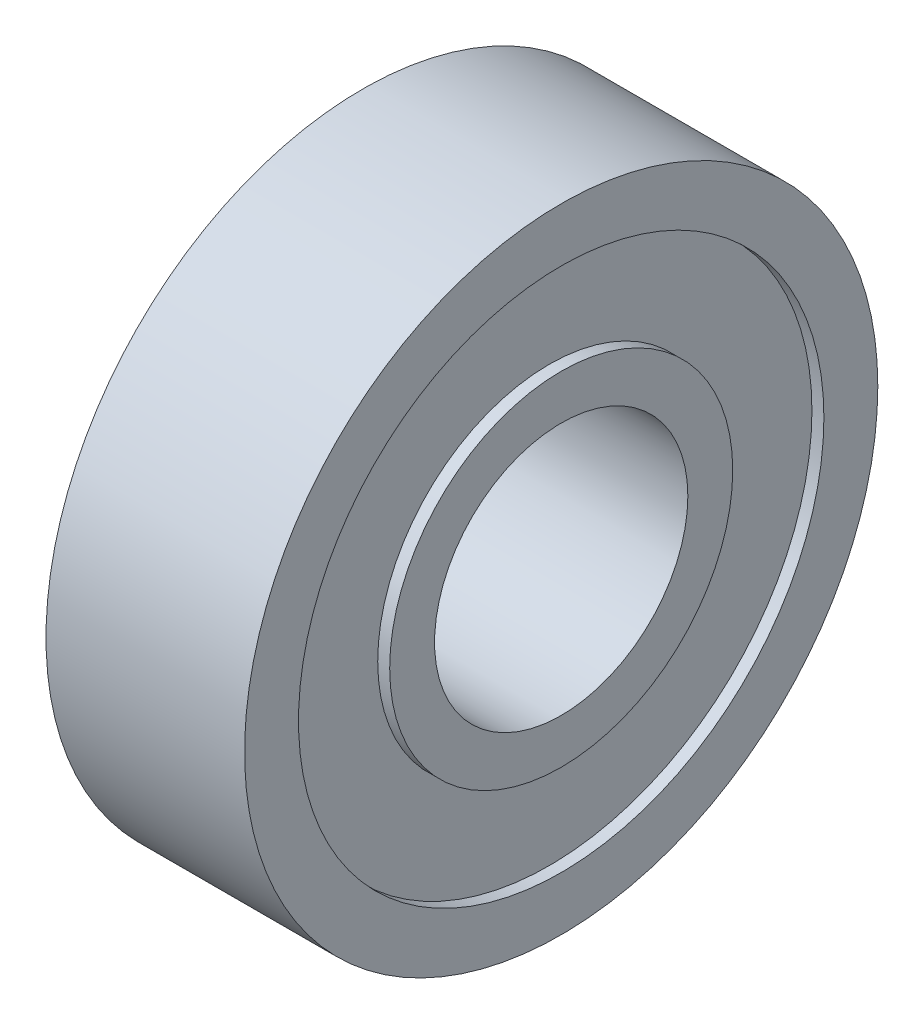
ISO-10303-21;
HEADER;
FILE_DESCRIPTION(('STEP AP214'),'2;1');
FILE_NAME('part.step','',(''),(''),'','','');
FILE_SCHEMA(('AUTOMOTIVE_DESIGN { 1 0 10303 214 1 1 1 1 }'));
ENDSEC;
DATA;
#1=APPLICATION_CONTEXT('core data for automotive mechanical design processes');
#2=APPLICATION_PROTOCOL_DEFINITION('international standard','automotive_design',2000,#1);
#3=PRODUCT_CONTEXT('',#1,'mechanical');
#4=PRODUCT('Part','Part','',(#3));
#5=PRODUCT_RELATED_PRODUCT_CATEGORY('part','',(#4));
#6=PRODUCT_DEFINITION_FORMATION('','',#4);
#7=PRODUCT_DEFINITION_CONTEXT('part definition',#1,'design');
#8=PRODUCT_DEFINITION('design','',#6,#7);
#9=PRODUCT_DEFINITION_SHAPE('','',#8);
#10=(LENGTH_UNIT() NAMED_UNIT(*) SI_UNIT(.MILLI.,.METRE.));
#11=(NAMED_UNIT(*) PLANE_ANGLE_UNIT() SI_UNIT($,.RADIAN.));
#12=(NAMED_UNIT(*) SI_UNIT($,.STERADIAN.) SOLID_ANGLE_UNIT());
#13=UNCERTAINTY_MEASURE_WITH_UNIT(LENGTH_MEASURE(1.E-05),#10,'distance_accuracy_value','');
#14=(GEOMETRIC_REPRESENTATION_CONTEXT(3) GLOBAL_UNCERTAINTY_ASSIGNED_CONTEXT((#13)) GLOBAL_UNIT_ASSIGNED_CONTEXT((#10,
#11,#12)) REPRESENTATION_CONTEXT('',''));
#15=CARTESIAN_POINT('',(0.,0.,0.));
#16=DIRECTION('',(0.,0.,1.));
#17=DIRECTION('',(1.,0.,0.));
#18=AXIS2_PLACEMENT_3D('',#15,#16,#17);
#19=CARTESIAN_POINT('',(-2.4892,3.175,0.));
#20=DIRECTION('',(-1.,0.,0.));
#21=DIRECTION('',(0.,0.,1.));
#22=AXIS2_PLACEMENT_3D('',#19,#20,#21);
#23=PLANE('',#22);
#24=CARTESIAN_POINT('',(-2.4892,0.,0.));
#25=DIRECTION('',(1.,0.,0.));
#26=DIRECTION('',(0.,0.,-1.));
#27=AXIS2_PLACEMENT_3D('',#24,#25,#26);
#28=CIRCLE('',#27,3.175);
#29=CARTESIAN_POINT('',(-2.4892,0.,-3.175));
#30=VERTEX_POINT('',#29);
#31=EDGE_CURVE('E73',#30,#30,#28,.T.);
#32=ORIENTED_EDGE('',*,*,#31,.T.);
#33=EDGE_LOOP('',(#32));
#34=FACE_BOUND('',#33,.T.);
#35=CARTESIAN_POINT('',(-2.4892,0.,0.));
#36=DIRECTION('',(1.,0.,0.));
#37=DIRECTION('',(0.,0.,-1.));
#38=AXIS2_PLACEMENT_3D('',#35,#36,#37);
#39=CIRCLE('',#38,4.3);
#40=CARTESIAN_POINT('',(-2.4892,0.,-4.3));
#41=VERTEX_POINT('',#40);
#42=EDGE_CURVE('E10',#41,#41,#39,.T.);
#43=ORIENTED_EDGE('',*,*,#42,.F.);
#44=EDGE_LOOP('',(#43));
#45=FACE_BOUND('',#44,.T.);
#46=ADVANCED_FACE('F33',(#34,#45),#23,.T.);
#47=CARTESIAN_POINT('',(0.,0.,0.));
#48=DIRECTION('',(1.,0.,0.));
#49=DIRECTION('',(0.,0.,-1.));
#50=AXIS2_PLACEMENT_3D('',#47,#48,#49);
#51=CYLINDRICAL_SURFACE('',#50,4.3);
#52=ORIENTED_EDGE('',*,*,#42,.T.);
#53=EDGE_LOOP('',(#52));
#54=FACE_BOUND('',#53,.T.);
#55=CARTESIAN_POINT('',(-2.1892,0.,0.));
#56=DIRECTION('',(1.,0.,0.));
#57=DIRECTION('',(0.,0.,-1.));
#58=AXIS2_PLACEMENT_3D('',#55,#56,#57);
#59=CIRCLE('',#58,4.3);
#60=CARTESIAN_POINT('',(-2.1892,0.,-4.3));
#61=VERTEX_POINT('',#60);
#62=EDGE_CURVE('E39',#61,#61,#59,.T.);
#63=ORIENTED_EDGE('',*,*,#62,.F.);
#64=EDGE_LOOP('',(#63));
#65=FACE_BOUND('',#64,.T.);
#66=ADVANCED_FACE('F91',(#54,#65),#51,.T.);
#67=CARTESIAN_POINT('',(-2.1892,4.3,0.));
#68=DIRECTION('',(-1.,0.,0.));
#69=DIRECTION('',(0.,0.,1.));
#70=AXIS2_PLACEMENT_3D('',#67,#68,#69);
#71=PLANE('',#70);
#72=ORIENTED_EDGE('',*,*,#62,.T.);
#73=EDGE_LOOP('',(#72));
#74=FACE_BOUND('',#73,.T.);
#75=CARTESIAN_POINT('',(-2.1892,0.,0.));
#76=DIRECTION('',(1.,0.,0.));
#77=DIRECTION('',(0.,0.,-1.));
#78=AXIS2_PLACEMENT_3D('',#75,#76,#77);
#79=CIRCLE('',#78,6.586);
#80=CARTESIAN_POINT('',(-2.1892,0.,-6.586));
#81=VERTEX_POINT('',#80);
#82=EDGE_CURVE('E43',#81,#81,#79,.T.);
#83=ORIENTED_EDGE('',*,*,#82,.F.);
#84=EDGE_LOOP('',(#83));
#85=FACE_BOUND('',#84,.T.);
#86=ADVANCED_FACE('F95',(#74,#85),#71,.T.);
#87=CARTESIAN_POINT('',(0.,0.,0.));
#88=DIRECTION('',(1.,0.,0.));
#89=DIRECTION('',(0.,0.,-1.));
#90=AXIS2_PLACEMENT_3D('',#87,#88,#89);
#91=CYLINDRICAL_SURFACE('',#90,6.586);
#92=ORIENTED_EDGE('',*,*,#82,.T.);
#93=EDGE_LOOP('',(#92));
#94=FACE_BOUND('',#93,.T.);
#95=CARTESIAN_POINT('',(-2.4892,0.,0.));
#96=DIRECTION('',(1.,0.,0.));
#97=DIRECTION('',(0.,0.,-1.));
#98=AXIS2_PLACEMENT_3D('',#95,#96,#97);
#99=CIRCLE('',#98,6.586);
#100=CARTESIAN_POINT('',(-2.4892,0.,-6.586));
#101=VERTEX_POINT('',#100);
#102=EDGE_CURVE('E47',#101,#101,#99,.T.);
#103=ORIENTED_EDGE('',*,*,#102,.F.);
#104=EDGE_LOOP('',(#103));
#105=FACE_BOUND('',#104,.T.);
#106=ADVANCED_FACE('F99',(#94,#105),#91,.F.);
#107=CARTESIAN_POINT('',(-2.4892,6.586,0.));
#108=DIRECTION('',(-1.,0.,0.));
#109=DIRECTION('',(0.,0.,1.));
#110=AXIS2_PLACEMENT_3D('',#107,#108,#109);
#111=PLANE('',#110);
#112=ORIENTED_EDGE('',*,*,#102,.T.);
#113=EDGE_LOOP('',(#112));
#114=FACE_BOUND('',#113,.T.);
#115=CARTESIAN_POINT('',(-2.4892,0.,0.));
#116=DIRECTION('',(1.,0.,0.));
#117=DIRECTION('',(0.,0.,-1.));
#118=AXIS2_PLACEMENT_3D('',#115,#116,#117);
#119=CIRCLE('',#118,7.9375);
#120=CARTESIAN_POINT('',(-2.4892,0.,-7.9375));
#121=VERTEX_POINT('',#120);
#122=EDGE_CURVE('E52',#121,#121,#119,.T.);
#123=ORIENTED_EDGE('',*,*,#122,.F.);
#124=EDGE_LOOP('',(#123));
#125=FACE_BOUND('',#124,.T.);
#126=ADVANCED_FACE('F105',(#114,#125),#111,.T.);
#127=CARTESIAN_POINT('',(0.,0.,0.));
#128=DIRECTION('',(1.,0.,0.));
#129=DIRECTION('',(0.,0.,-1.));
#130=AXIS2_PLACEMENT_3D('',#127,#128,#129);
#131=CYLINDRICAL_SURFACE('',#130,7.9375);
#132=ORIENTED_EDGE('',*,*,#122,.T.);
#133=EDGE_LOOP('',(#132));
#134=FACE_BOUND('',#133,.T.);
#135=CARTESIAN_POINT('',(2.4892,0.,0.));
#136=DIRECTION('',(1.,0.,0.));
#137=DIRECTION('',(0.,0.,-1.));
#138=AXIS2_PLACEMENT_3D('',#135,#136,#137);
#139=CIRCLE('',#138,7.9375);
#140=CARTESIAN_POINT('',(2.4892,0.,-7.9375));
#141=VERTEX_POINT('',#140);
#142=EDGE_CURVE('E55',#141,#141,#139,.T.);
#143=ORIENTED_EDGE('',*,*,#142,.F.);
#144=EDGE_LOOP('',(#143));
#145=FACE_BOUND('',#144,.T.);
#146=ADVANCED_FACE('F109',(#134,#145),#131,.T.);
#147=CARTESIAN_POINT('',(2.4892,6.586,0.));
#148=DIRECTION('',(1.,0.,0.));
#149=DIRECTION('',(0.,0.,-1.));
#150=AXIS2_PLACEMENT_3D('',#147,#148,#149);
#151=PLANE('',#150);
#152=ORIENTED_EDGE('',*,*,#142,.T.);
#153=EDGE_LOOP('',(#152));
#154=FACE_BOUND('',#153,.T.);
#155=CARTESIAN_POINT('',(2.4892,0.,0.));
#156=DIRECTION('',(1.,0.,0.));
#157=DIRECTION('',(0.,0.,-1.));
#158=AXIS2_PLACEMENT_3D('',#155,#156,#157);
#159=CIRCLE('',#158,6.586);
#160=CARTESIAN_POINT('',(2.4892,0.,-6.586));
#161=VERTEX_POINT('',#160);
#162=EDGE_CURVE('E58',#161,#161,#159,.T.);
#163=ORIENTED_EDGE('',*,*,#162,.F.);
#164=EDGE_LOOP('',(#163));
#165=FACE_BOUND('',#164,.T.);
#166=ADVANCED_FACE('F113',(#154,#165),#151,.T.);
#167=CARTESIAN_POINT('',(0.,0.,0.));
#168=DIRECTION('',(1.,0.,0.));
#169=DIRECTION('',(0.,0.,-1.));
#170=AXIS2_PLACEMENT_3D('',#167,#168,#169);
#171=CYLINDRICAL_SURFACE('',#170,6.586);
#172=ORIENTED_EDGE('',*,*,#162,.T.);
#173=EDGE_LOOP('',(#172));
#174=FACE_BOUND('',#173,.T.);
#175=CARTESIAN_POINT('',(2.1892,0.,0.));
#176=DIRECTION('',(1.,0.,0.));
#177=DIRECTION('',(0.,0.,-1.));
#178=AXIS2_PLACEMENT_3D('',#175,#176,#177);
#179=CIRCLE('',#178,6.586);
#180=CARTESIAN_POINT('',(2.1892,0.,-6.586));
#181=VERTEX_POINT('',#180);
#182=EDGE_CURVE('E61',#181,#181,#179,.T.);
#183=ORIENTED_EDGE('',*,*,#182,.F.);
#184=EDGE_LOOP('',(#183));
#185=FACE_BOUND('',#184,.T.);
#186=ADVANCED_FACE('F117',(#174,#185),#171,.F.);
#187=CARTESIAN_POINT('',(2.1892,4.3,0.));
#188=DIRECTION('',(1.,0.,0.));
#189=DIRECTION('',(0.,0.,-1.));
#190=AXIS2_PLACEMENT_3D('',#187,#188,#189);
#191=PLANE('',#190);
#192=ORIENTED_EDGE('',*,*,#182,.T.);
#193=EDGE_LOOP('',(#192));
#194=FACE_BOUND('',#193,.T.);
#195=CARTESIAN_POINT('',(2.1892,0.,0.));
#196=DIRECTION('',(1.,0.,0.));
#197=DIRECTION('',(0.,0.,-1.));
#198=AXIS2_PLACEMENT_3D('',#195,#196,#197);
#199=CIRCLE('',#198,4.3);
#200=CARTESIAN_POINT('',(2.1892,0.,-4.3));
#201=VERTEX_POINT('',#200);
#202=EDGE_CURVE('E64',#201,#201,#199,.T.);
#203=ORIENTED_EDGE('',*,*,#202,.F.);
#204=EDGE_LOOP('',(#203));
#205=FACE_BOUND('',#204,.T.);
#206=ADVANCED_FACE('F121',(#194,#205),#191,.T.);
#207=CARTESIAN_POINT('',(0.,0.,0.));
#208=DIRECTION('',(1.,0.,0.));
#209=DIRECTION('',(0.,0.,-1.));
#210=AXIS2_PLACEMENT_3D('',#207,#208,#209);
#211=CYLINDRICAL_SURFACE('',#210,4.3);
#212=ORIENTED_EDGE('',*,*,#202,.T.);
#213=EDGE_LOOP('',(#212));
#214=FACE_BOUND('',#213,.T.);
#215=CARTESIAN_POINT('',(2.4892,0.,0.));
#216=DIRECTION('',(1.,0.,0.));
#217=DIRECTION('',(0.,0.,-1.));
#218=AXIS2_PLACEMENT_3D('',#215,#216,#217);
#219=CIRCLE('',#218,4.3);
#220=CARTESIAN_POINT('',(2.4892,0.,-4.3));
#221=VERTEX_POINT('',#220);
#222=EDGE_CURVE('E67',#221,#221,#219,.T.);
#223=ORIENTED_EDGE('',*,*,#222,.F.);
#224=EDGE_LOOP('',(#223));
#225=FACE_BOUND('',#224,.T.);
#226=ADVANCED_FACE('F87',(#214,#225),#211,.T.);
#227=CARTESIAN_POINT('',(2.4892,3.175,0.));
#228=DIRECTION('',(1.,0.,0.));
#229=DIRECTION('',(0.,0.,-1.));
#230=AXIS2_PLACEMENT_3D('',#227,#228,#229);
#231=PLANE('',#230);
#232=ORIENTED_EDGE('',*,*,#222,.T.);
#233=EDGE_LOOP('',(#232));
#234=FACE_BOUND('',#233,.T.);
#235=CARTESIAN_POINT('',(2.4892,0.,0.));
#236=DIRECTION('',(1.,0.,0.));
#237=DIRECTION('',(0.,0.,-1.));
#238=AXIS2_PLACEMENT_3D('',#235,#236,#237);
#239=CIRCLE('',#238,3.175);
#240=CARTESIAN_POINT('',(2.4892,0.,-3.175));
#241=VERTEX_POINT('',#240);
#242=EDGE_CURVE('E70',#241,#241,#239,.T.);
#243=ORIENTED_EDGE('',*,*,#242,.F.);
#244=EDGE_LOOP('',(#243));
#245=FACE_BOUND('',#244,.T.);
#246=ADVANCED_FACE('F81',(#234,#245),#231,.T.);
#247=CARTESIAN_POINT('',(0.,0.,0.));
#248=DIRECTION('',(1.,0.,0.));
#249=DIRECTION('',(0.,0.,-1.));
#250=AXIS2_PLACEMENT_3D('',#247,#248,#249);
#251=CYLINDRICAL_SURFACE('',#250,3.175);
#252=ORIENTED_EDGE('',*,*,#242,.T.);
#253=EDGE_LOOP('',(#252));
#254=FACE_BOUND('',#253,.T.);
#255=ORIENTED_EDGE('',*,*,#31,.F.);
#256=EDGE_LOOP('',(#255));
#257=FACE_BOUND('',#256,.T.);
#258=ADVANCED_FACE('F79',(#254,#257),#251,.F.);
#259=CLOSED_SHELL('',(#46,#66,#86,#106,#126,#146,#166,#186,#206,#226,#246,#258));
#260=MANIFOLD_SOLID_BREP('B2',#259);
#261=ADVANCED_BREP_SHAPE_REPRESENTATION('',(#18,#260),#14);
#262=SHAPE_DEFINITION_REPRESENTATION(#9,#261);
ENDSEC;
END-ISO-10303-21;
